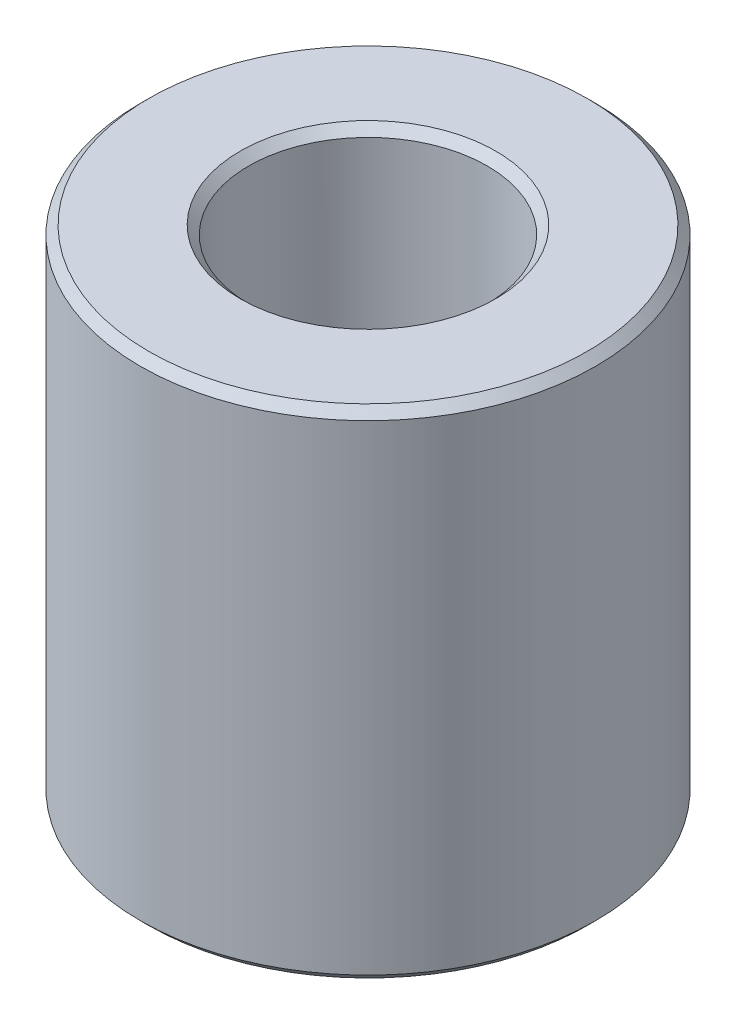
ISO-10303-21;
HEADER;
FILE_DESCRIPTION(('STEP AP214'),'2;1');
FILE_NAME('part.step','',(''),(''),'','','');
FILE_SCHEMA(('AUTOMOTIVE_DESIGN { 1 0 10303 214 1 1 1 1 }'));
ENDSEC;
DATA;
#1=APPLICATION_CONTEXT('core data for automotive mechanical design processes');
#2=APPLICATION_PROTOCOL_DEFINITION('international standard','automotive_design',2000,#1);
#3=PRODUCT_CONTEXT('',#1,'mechanical');
#4=PRODUCT('Part','Part','',(#3));
#5=PRODUCT_RELATED_PRODUCT_CATEGORY('part','',(#4));
#6=PRODUCT_DEFINITION_FORMATION('','',#4);
#7=PRODUCT_DEFINITION_CONTEXT('part definition',#1,'design');
#8=PRODUCT_DEFINITION('design','',#6,#7);
#9=PRODUCT_DEFINITION_SHAPE('','',#8);
#10=(LENGTH_UNIT() NAMED_UNIT(*) SI_UNIT(.MILLI.,.METRE.));
#11=(NAMED_UNIT(*) PLANE_ANGLE_UNIT() SI_UNIT($,.RADIAN.));
#12=(NAMED_UNIT(*) SI_UNIT($,.STERADIAN.) SOLID_ANGLE_UNIT());
#13=UNCERTAINTY_MEASURE_WITH_UNIT(LENGTH_MEASURE(1.E-05),#10,'distance_accuracy_value','');
#14=(GEOMETRIC_REPRESENTATION_CONTEXT(3) GLOBAL_UNCERTAINTY_ASSIGNED_CONTEXT((#13)) GLOBAL_UNIT_ASSIGNED_CONTEXT((#10,
#11,#12)) REPRESENTATION_CONTEXT('',''));
#15=CARTESIAN_POINT('',(0.,0.,0.));
#16=DIRECTION('',(0.,0.,1.));
#17=DIRECTION('',(1.,0.,0.));
#18=AXIS2_PLACEMENT_3D('',#15,#16,#17);
#19=CARTESIAN_POINT('',(0.,103.715979349174,0.));
#20=DIRECTION('',(0.,-1.,0.));
#21=DIRECTION('',(0.,0.,-1.));
#22=AXIS2_PLACEMENT_3D('',#19,#20,#21);
#23=CYLINDRICAL_SURFACE('',#22,47.5);
#24=CARTESIAN_POINT('',(0.,1.78482888837593,0.));
#25=DIRECTION('',(0.,1.,0.));
#26=DIRECTION('',(0.,0.,1.));
#27=AXIS2_PLACEMENT_3D('',#24,#25,#26);
#28=CIRCLE('',#27,47.5);
#29=CARTESIAN_POINT('',(0.,1.78482888837592,-47.5));
#30=VERTEX_POINT('',#29);
#31=EDGE_CURVE('E10',#30,#30,#28,.T.);
#32=CARTESIAN_POINT('',(0.,101.931150460799,0.));
#33=DIRECTION('',(0.,1.,0.));
#34=DIRECTION('',(0.,0.,1.));
#35=AXIS2_PLACEMENT_3D('',#32,#33,#34);
#36=CIRCLE('',#35,47.5);
#37=CARTESIAN_POINT('',(0.,101.931150460799,-47.5));
#38=VERTEX_POINT('',#37);
#39=EDGE_CURVE('E50',#38,#38,#36,.F.);
#40=CARTESIAN_POINT('',(0.,1.78482888837592,-47.5));
#41=CARTESIAN_POINT('',(0.,2.82801973808865,-47.5));
#42=CARTESIAN_POINT('',(0.,3.87121058780139,-47.5));
#43=CARTESIAN_POINT('',(0.,5.95759228722686,-47.5));
#44=CARTESIAN_POINT('',(0.,7.00078313693959,-47.5));
#45=CARTESIAN_POINT('',(0.,9.08716483636506,-47.5));
#46=CARTESIAN_POINT('',(0.,10.1303556860778,-47.5));
#47=CARTESIAN_POINT('',(0.,12.2167373855033,-47.5));
#48=CARTESIAN_POINT('',(0.,13.259928235216,-47.5));
#49=CARTESIAN_POINT('',(0.,15.3463099346415,-47.5));
#50=CARTESIAN_POINT('',(0.,16.3895007843542,-47.5));
#51=CARTESIAN_POINT('',(0.,18.4758824837797,-47.5));
#52=CARTESIAN_POINT('',(0.,19.5190733334924,-47.5));
#53=CARTESIAN_POINT('',(0.,21.6054550329179,-47.5));
#54=CARTESIAN_POINT('',(0.,22.6486458826306,-47.5));
#55=CARTESIAN_POINT('',(0.,24.7350275820561,-47.5));
#56=CARTESIAN_POINT('',(0.,25.7782184317688,-47.5));
#57=CARTESIAN_POINT('',(0.,27.8646001311943,-47.5));
#58=CARTESIAN_POINT('',(0.,28.907790980907,-47.5));
#59=CARTESIAN_POINT('',(0.,30.9941726803325,-47.5));
#60=CARTESIAN_POINT('',(0.,32.0373635300452,-47.5));
#61=CARTESIAN_POINT('',(0.,34.1237452294707,-47.5));
#62=CARTESIAN_POINT('',(0.,35.1669360791835,-47.5));
#63=CARTESIAN_POINT('',(0.,37.2533177786089,-47.5));
#64=CARTESIAN_POINT('',(0.,38.2965086283217,-47.5));
#65=CARTESIAN_POINT('',(0.,40.3828903277471,-47.5));
#66=CARTESIAN_POINT('',(0.,41.4260811774599,-47.5));
#67=CARTESIAN_POINT('',(0.,43.5124628768853,-47.5));
#68=CARTESIAN_POINT('',(0.,44.5556537265981,-47.5));
#69=CARTESIAN_POINT('',(0.,46.6420354260236,-47.5));
#70=CARTESIAN_POINT('',(0.,47.6852262757363,-47.5));
#71=CARTESIAN_POINT('',(0.,49.7716079751618,-47.5));
#72=CARTESIAN_POINT('',(0.,50.8147988248745,-47.5));
#73=CARTESIAN_POINT('',(0.,52.9011805243,-47.5));
#74=CARTESIAN_POINT('',(0.,53.9443713740127,-47.5));
#75=CARTESIAN_POINT('',(0.,56.0307530734382,-47.5));
#76=CARTESIAN_POINT('',(0.,57.0739439231509,-47.5));
#77=CARTESIAN_POINT('',(0.,59.1603256225764,-47.5));
#78=CARTESIAN_POINT('',(0.,60.2035164722891,-47.5));
#79=CARTESIAN_POINT('',(0.,62.2898981717146,-47.5));
#80=CARTESIAN_POINT('',(0.,63.3330890214273,-47.5));
#81=CARTESIAN_POINT('',(0.,65.4194707208528,-47.5));
#82=CARTESIAN_POINT('',(0.,66.4626615705655,-47.5));
#83=CARTESIAN_POINT('',(0.,68.549043269991,-47.5));
#84=CARTESIAN_POINT('',(0.,69.5922341197037,-47.5));
#85=CARTESIAN_POINT('',(0.,71.6786158191292,-47.5));
#86=CARTESIAN_POINT('',(0.,72.7218066688419,-47.5));
#87=CARTESIAN_POINT('',(0.,74.8081883682674,-47.5));
#88=CARTESIAN_POINT('',(0.,75.8513792179802,-47.5));
#89=CARTESIAN_POINT('',(0.,77.9377609174056,-47.5));
#90=CARTESIAN_POINT('',(0.,78.9809517671184,-47.5));
#91=CARTESIAN_POINT('',(0.,81.0673334665438,-47.5));
#92=CARTESIAN_POINT('',(0.,82.1105243162566,-47.5));
#93=CARTESIAN_POINT('',(0.,84.196906015682,-47.5));
#94=CARTESIAN_POINT('',(0.,85.2400968653948,-47.5));
#95=CARTESIAN_POINT('',(0.,87.3264785648202,-47.5));
#96=CARTESIAN_POINT('',(0.,88.369669414533,-47.5));
#97=CARTESIAN_POINT('',(0.,90.4560511139585,-47.5));
#98=CARTESIAN_POINT('',(0.,91.4992419636712,-47.5));
#99=CARTESIAN_POINT('',(0.,93.5856236630967,-47.5));
#100=CARTESIAN_POINT('',(0.,94.6288145128094,-47.5));
#101=CARTESIAN_POINT('',(0.,96.7151962122349,-47.5));
#102=CARTESIAN_POINT('',(0.,97.7583870619476,-47.5));
#103=CARTESIAN_POINT('',(0.,99.8447687613731,-47.5));
#104=CARTESIAN_POINT('',(0.,100.887959611086,-47.5));
#105=CARTESIAN_POINT('',(0.,101.931150460799,-47.5));
#106=B_SPLINE_CURVE_WITH_KNOTS('',3,(#40,#41,#42,#43,#44,#45,#46,#47,#48,#49,#50,#51,#52,#53,
#54,#55,#56,#57,#58,#59,#60,#61,#62,#63,#64,#65,#66,#67,#68,#69,#70,#71,#72,#73,#74,#75,#76,#77,
#78,#79,#80,#81,#82,#83,#84,#85,#86,#87,#88,#89,#90,#91,#92,#93,#94,#95,#96,#97,#98,#99,#100,
#101,#102,#103,#104,#105),.UNSPECIFIED.,.F.,.F.,(4,2,2,2,2,2,2,2,2,2,2,2,2,2,2,2,2,2,2,2,2,2,2,
2,2,2,2,2,2,2,2,2,4),(0.,3.1295725491382,6.25914509827641,9.38871764741463,12.5182901965528,
15.647862745691,18.7774352948293,21.9070078439675,25.0365803931057,28.1661529422439,
31.2957254913821,34.4252980405203,37.5548705896585,40.6844431387967,43.8140156879349,
46.9435882370731,50.0731607862113,53.2027333353495,56.3323058844877,59.4618784336259,
62.5914509827641,65.7210235319023,68.8505960810406,71.9801686301788,75.109741179317,
78.2393137284552,81.3688862775934,84.4984588267316,87.6280313758698,90.757603925008,
93.8871764741462,97.0167490232844,100.146321572423),.UNSPECIFIED.);
#107=EDGE_CURVE('BSEAM39',#30,#38,#106,.T.);
#108=ORIENTED_EDGE('',*,*,#31,.T.);
#109=ORIENTED_EDGE('',*,*,#39,.T.);
#110=ORIENTED_EDGE('',*,*,#107,.T.);
#111=ORIENTED_EDGE('',*,*,#107,.F.);
#112=EDGE_LOOP('',(#108,#110,#109,#111));
#113=FACE_BOUND('',#112,.T.);
#114=ADVANCED_FACE('F39',(#113),#23,.T.);
#115=CARTESIAN_POINT('',(0.,103.715979349174,0.));
#116=DIRECTION('',(0.,1.,0.));
#117=DIRECTION('',(0.,0.,1.));
#118=AXIS2_PLACEMENT_3D('',#115,#116,#117);
#119=PLANE('',#118);
#120=CARTESIAN_POINT('',(0.,103.715979349174,0.));
#121=DIRECTION('',(0.,1.,0.));
#122=DIRECTION('',(0.,0.,1.));
#123=AXIS2_PLACEMENT_3D('',#120,#121,#122);
#124=CIRCLE('',#123,26.6723977471832);
#125=CARTESIAN_POINT('',(0.,103.715979349174,26.6723977471832));
#126=VERTEX_POINT('',#125);
#127=EDGE_CURVE('E58',#126,#126,#124,.F.);
#128=ORIENTED_EDGE('',*,*,#127,.T.);
#129=EDGE_LOOP('',(#128));
#130=FACE_BOUND('',#129,.T.);
#131=CARTESIAN_POINT('',(0.,103.715979349174,0.));
#132=DIRECTION('',(0.,1.,0.));
#133=DIRECTION('',(0.,0.,1.));
#134=AXIS2_PLACEMENT_3D('',#131,#132,#133);
#135=CIRCLE('',#134,45.7151711116242);
#136=CARTESIAN_POINT('',(0.,103.715979349174,45.7151711116242));
#137=VERTEX_POINT('',#136);
#138=EDGE_CURVE('E61',#137,#137,#135,.T.);
#139=ORIENTED_EDGE('',*,*,#138,.T.);
#140=EDGE_LOOP('',(#139));
#141=FACE_BOUND('',#140,.T.);
#142=ADVANCED_FACE('F88',(#130,#141),#119,.T.);
#143=CARTESIAN_POINT('',(0.,0.,0.));
#144=DIRECTION('',(0.,1.,0.));
#145=DIRECTION('',(0.,0.,1.));
#146=AXIS2_PLACEMENT_3D('',#143,#144,#145);
#147=PLANE('',#146);
#148=CARTESIAN_POINT('',(0.,0.,0.));
#149=DIRECTION('',(0.,1.,0.));
#150=DIRECTION('',(0.,0.,1.));
#151=AXIS2_PLACEMENT_3D('',#148,#149,#150);
#152=CIRCLE('',#151,26.6723977471831);
#153=CARTESIAN_POINT('',(0.,0.,26.6723977471831));
#154=VERTEX_POINT('',#153);
#155=EDGE_CURVE('E51',#154,#154,#152,.T.);
#156=ORIENTED_EDGE('',*,*,#155,.T.);
#157=EDGE_LOOP('',(#156));
#158=FACE_BOUND('',#157,.T.);
#159=CARTESIAN_POINT('',(0.,0.,0.));
#160=DIRECTION('',(0.,1.,0.));
#161=DIRECTION('',(0.,0.,1.));
#162=AXIS2_PLACEMENT_3D('',#159,#160,#161);
#163=CIRCLE('',#162,45.7151711116241);
#164=CARTESIAN_POINT('',(0.,0.,45.7151711116241));
#165=VERTEX_POINT('',#164);
#166=EDGE_CURVE('E54',#165,#165,#163,.F.);
#167=ORIENTED_EDGE('',*,*,#166,.T.);
#168=EDGE_LOOP('',(#167));
#169=FACE_BOUND('',#168,.T.);
#170=ADVANCED_FACE('F83',(#158,#169),#147,.F.);
#171=CARTESIAN_POINT('',(0.,103.715979349174,0.));
#172=DIRECTION('',(0.,-1.,0.));
#173=DIRECTION('',(0.,0.,-1.));
#174=AXIS2_PLACEMENT_3D('',#171,#172,#173);
#175=CYLINDRICAL_SURFACE('',#174,24.8875688588073);
#176=CARTESIAN_POINT('',(0.,101.931150460798,0.));
#177=DIRECTION('',(0.,1.,0.));
#178=DIRECTION('',(0.,0.,1.));
#179=AXIS2_PLACEMENT_3D('',#176,#177,#178);
#180=CIRCLE('',#179,24.8875688588073);
#181=CARTESIAN_POINT('',(0.,101.931150460798,-24.8875688588073));
#182=VERTEX_POINT('',#181);
#183=EDGE_CURVE('E67',#182,#182,#180,.T.);
#184=CARTESIAN_POINT('',(0.,1.78482888837581,0.));
#185=DIRECTION('',(0.,1.,0.));
#186=DIRECTION('',(0.,0.,1.));
#187=AXIS2_PLACEMENT_3D('',#184,#185,#186);
#188=CIRCLE('',#187,24.8875688588073);
#189=CARTESIAN_POINT('',(0.,1.78482888837581,-24.8875688588073));
#190=VERTEX_POINT('',#189);
#191=EDGE_CURVE('E69',#190,#190,#188,.F.);
#192=CARTESIAN_POINT('',(0.,101.931150460798,-24.8875688588073));
#193=CARTESIAN_POINT('',(0.,100.887959611086,-24.8875688588073));
#194=CARTESIAN_POINT('',(0.,99.8447687613729,-24.8875688588073));
#195=CARTESIAN_POINT('',(0.,97.7583870619474,-24.8875688588073));
#196=CARTESIAN_POINT('',(0.,96.7151962122347,-24.8875688588073));
#197=CARTESIAN_POINT('',(0.,94.6288145128092,-24.8875688588073));
#198=CARTESIAN_POINT('',(0.,93.5856236630965,-24.8875688588073));
#199=CARTESIAN_POINT('',(0.,91.499241963671,-24.8875688588073));
#200=CARTESIAN_POINT('',(0.,90.4560511139583,-24.8875688588073));
#201=CARTESIAN_POINT('',(0.,88.3696694145328,-24.8875688588073));
#202=CARTESIAN_POINT('',(0.,87.3264785648201,-24.8875688588073));
#203=CARTESIAN_POINT('',(0.,85.2400968653946,-24.8875688588073));
#204=CARTESIAN_POINT('',(0.,84.1969060156819,-24.8875688588073));
#205=CARTESIAN_POINT('',(0.,82.1105243162564,-24.8875688588073));
#206=CARTESIAN_POINT('',(0.,81.0673334665437,-24.8875688588073));
#207=CARTESIAN_POINT('',(0.,78.9809517671182,-24.8875688588073));
#208=CARTESIAN_POINT('',(0.,77.9377609174055,-24.8875688588073));
#209=CARTESIAN_POINT('',(0.,75.85137921798,-24.8875688588073));
#210=CARTESIAN_POINT('',(0.,74.8081883682673,-24.8875688588073));
#211=CARTESIAN_POINT('',(0.,72.7218066688418,-24.8875688588073));
#212=CARTESIAN_POINT('',(0.,71.6786158191291,-24.8875688588073));
#213=CARTESIAN_POINT('',(0.,69.5922341197036,-24.8875688588073));
#214=CARTESIAN_POINT('',(0.,68.5490432699908,-24.8875688588073));
#215=CARTESIAN_POINT('',(0.,66.4626615705654,-24.8875688588073));
#216=CARTESIAN_POINT('',(0.,65.4194707208526,-24.8875688588073));
#217=CARTESIAN_POINT('',(0.,63.3330890214272,-24.8875688588073));
#218=CARTESIAN_POINT('',(0.,62.2898981717144,-24.8875688588073));
#219=CARTESIAN_POINT('',(0.,60.203516472289,-24.8875688588073));
#220=CARTESIAN_POINT('',(0.,59.1603256225762,-24.8875688588073));
#221=CARTESIAN_POINT('',(0.,57.0739439231508,-24.8875688588073));
#222=CARTESIAN_POINT('',(0.,56.030753073438,-24.8875688588073));
#223=CARTESIAN_POINT('',(0.,53.9443713740126,-24.8875688588073));
#224=CARTESIAN_POINT('',(0.,52.9011805242998,-24.8875688588073));
#225=CARTESIAN_POINT('',(0.,50.8147988248744,-24.8875688588073));
#226=CARTESIAN_POINT('',(0.,49.7716079751616,-24.8875688588073));
#227=CARTESIAN_POINT('',(0.,47.6852262757361,-24.8875688588073));
#228=CARTESIAN_POINT('',(0.,46.6420354260234,-24.8875688588073));
#229=CARTESIAN_POINT('',(0.,44.5556537265979,-24.8875688588073));
#230=CARTESIAN_POINT('',(0.,43.5124628768852,-24.8875688588073));
#231=CARTESIAN_POINT('',(0.,41.4260811774597,-24.8875688588073));
#232=CARTESIAN_POINT('',(0.,40.382890327747,-24.8875688588073));
#233=CARTESIAN_POINT('',(0.,38.2965086283215,-24.8875688588073));
#234=CARTESIAN_POINT('',(0.,37.2533177786088,-24.8875688588073));
#235=CARTESIAN_POINT('',(0.,35.1669360791833,-24.8875688588073));
#236=CARTESIAN_POINT('',(0.,34.1237452294706,-24.8875688588073));
#237=CARTESIAN_POINT('',(0.,32.0373635300451,-24.8875688588073));
#238=CARTESIAN_POINT('',(0.,30.9941726803324,-24.8875688588073));
#239=CARTESIAN_POINT('',(0.,28.9077909809069,-24.8875688588073));
#240=CARTESIAN_POINT('',(0.,27.8646001311942,-24.8875688588073));
#241=CARTESIAN_POINT('',(0.,25.7782184317687,-24.8875688588073));
#242=CARTESIAN_POINT('',(0.,24.735027582056,-24.8875688588073));
#243=CARTESIAN_POINT('',(0.,22.6486458826305,-24.8875688588073));
#244=CARTESIAN_POINT('',(0.,21.6054550329178,-24.8875688588073));
#245=CARTESIAN_POINT('',(0.,19.5190733334923,-24.8875688588073));
#246=CARTESIAN_POINT('',(0.,18.4758824837796,-24.8875688588073));
#247=CARTESIAN_POINT('',(0.,16.3895007843541,-24.8875688588073));
#248=CARTESIAN_POINT('',(0.,15.3463099346414,-24.8875688588073));
#249=CARTESIAN_POINT('',(0.,13.2599282352159,-24.8875688588073));
#250=CARTESIAN_POINT('',(0.,12.2167373855032,-24.8875688588073));
#251=CARTESIAN_POINT('',(0.,10.1303556860777,-24.8875688588073));
#252=CARTESIAN_POINT('',(0.,9.08716483636495,-24.8875688588073));
#253=CARTESIAN_POINT('',(0.,7.00078313693948,-24.8875688588073));
#254=CARTESIAN_POINT('',(0.,5.95759228722675,-24.8875688588073));
#255=CARTESIAN_POINT('',(0.,3.87121058780128,-24.8875688588073));
#256=CARTESIAN_POINT('',(0.,2.82801973808854,-24.8875688588073));
#257=CARTESIAN_POINT('',(0.,1.78482888837581,-24.8875688588073));
#258=B_SPLINE_CURVE_WITH_KNOTS('',3,(#192,#193,#194,#195,#196,#197,#198,#199,#200,#201,#202,
#203,#204,#205,#206,#207,#208,#209,#210,#211,#212,#213,#214,#215,#216,#217,#218,#219,#220,#221,
#222,#223,#224,#225,#226,#227,#228,#229,#230,#231,#232,#233,#234,#235,#236,#237,#238,#239,#240,
#241,#242,#243,#244,#245,#246,#247,#248,#249,#250,#251,#252,#253,#254,#255,#256,#257),
.UNSPECIFIED.,.F.,.F.,(4,2,2,2,2,2,2,2,2,2,2,2,2,2,2,2,2,2,2,2,2,2,2,2,2,2,2,2,2,2,2,2,4),(0.,
3.12957254913822,6.25914509827642,9.38871764741463,12.5182901965528,15.647862745691,
18.7774352948292,21.9070078439674,25.0365803931056,28.1661529422439,31.2957254913821,
34.4252980405203,37.5548705896585,40.6844431387967,43.8140156879349,46.9435882370731,
50.0731607862113,53.2027333353495,56.3323058844877,59.4618784336259,62.5914509827641,
65.7210235319023,68.8505960810405,71.9801686301787,75.1097411793169,78.2393137284551,
81.3688862775933,84.4984588267316,87.6280313758698,90.757603925008,93.8871764741462,
97.0167490232844,100.146321572423),.UNSPECIFIED.);
#259=EDGE_CURVE('BSEAM71',#182,#190,#258,.T.);
#260=ORIENTED_EDGE('',*,*,#183,.T.);
#261=ORIENTED_EDGE('',*,*,#191,.T.);
#262=ORIENTED_EDGE('',*,*,#259,.T.);
#263=ORIENTED_EDGE('',*,*,#259,.F.);
#264=EDGE_LOOP('',(#260,#262,#261,#263));
#265=FACE_BOUND('',#264,.T.);
#266=ADVANCED_FACE('F71',(#265),#175,.F.);
#267=CARTESIAN_POINT('',(0.,101.931150460798,0.));
#268=DIRECTION('',(0.,1.,0.));
#269=DIRECTION('',(0.,0.,1.));
#270=AXIS2_PLACEMENT_3D('',#267,#268,#269);
#271=CONICAL_SURFACE('',#270,24.8875688588073,0.785398163397447);
#272=ORIENTED_EDGE('',*,*,#127,.F.);
#273=EDGE_LOOP('',(#272));
#274=FACE_BOUND('',#273,.T.);
#275=ORIENTED_EDGE('',*,*,#183,.F.);
#276=EDGE_LOOP('',(#275));
#277=FACE_BOUND('',#276,.T.);
#278=ADVANCED_FACE('F77',(#274,#277),#271,.F.);
#279=CARTESIAN_POINT('',(0.,0.,0.));
#280=DIRECTION('',(0.,-1.,0.));
#281=DIRECTION('',(0.,0.,-1.));
#282=AXIS2_PLACEMENT_3D('',#279,#280,#281);
#283=CONICAL_SURFACE('',#282,26.6723977471831,0.785398163397447);
#284=ORIENTED_EDGE('',*,*,#191,.F.);
#285=EDGE_LOOP('',(#284));
#286=FACE_BOUND('',#285,.T.);
#287=ORIENTED_EDGE('',*,*,#155,.F.);
#288=EDGE_LOOP('',(#287));
#289=FACE_BOUND('',#288,.T.);
#290=ADVANCED_FACE('F73',(#286,#289),#283,.F.);
#291=CARTESIAN_POINT('',(0.,1.78482888837593,0.));
#292=DIRECTION('',(0.,1.,0.));
#293=DIRECTION('',(0.,0.,1.));
#294=AXIS2_PLACEMENT_3D('',#291,#292,#293);
#295=CONICAL_SURFACE('',#294,47.5,0.785398163397454);
#296=ORIENTED_EDGE('',*,*,#166,.F.);
#297=EDGE_LOOP('',(#296));
#298=FACE_BOUND('',#297,.T.);
#299=ORIENTED_EDGE('',*,*,#31,.F.);
#300=EDGE_LOOP('',(#299));
#301=FACE_BOUND('',#300,.T.);
#302=ADVANCED_FACE('F76',(#298,#301),#295,.T.);
#303=CARTESIAN_POINT('',(0.,103.715979349174,0.));
#304=DIRECTION('',(0.,-1.,0.));
#305=DIRECTION('',(0.,0.,-1.));
#306=AXIS2_PLACEMENT_3D('',#303,#304,#305);
#307=CONICAL_SURFACE('',#306,45.7151711116242,0.785398163397456);
#308=ORIENTED_EDGE('',*,*,#39,.F.);
#309=EDGE_LOOP('',(#308));
#310=FACE_BOUND('',#309,.T.);
#311=ORIENTED_EDGE('',*,*,#138,.F.);
#312=EDGE_LOOP('',(#311));
#313=FACE_BOUND('',#312,.T.);
#314=ADVANCED_FACE('F45',(#310,#313),#307,.T.);
#315=CLOSED_SHELL('',(#114,#142,#170,#266,#278,#290,#302,#314));
#316=MANIFOLD_SOLID_BREP('B2',#315);
#317=ADVANCED_BREP_SHAPE_REPRESENTATION('',(#18,#316),#14);
#318=SHAPE_DEFINITION_REPRESENTATION(#9,#317);
ENDSEC;
END-ISO-10303-21;
